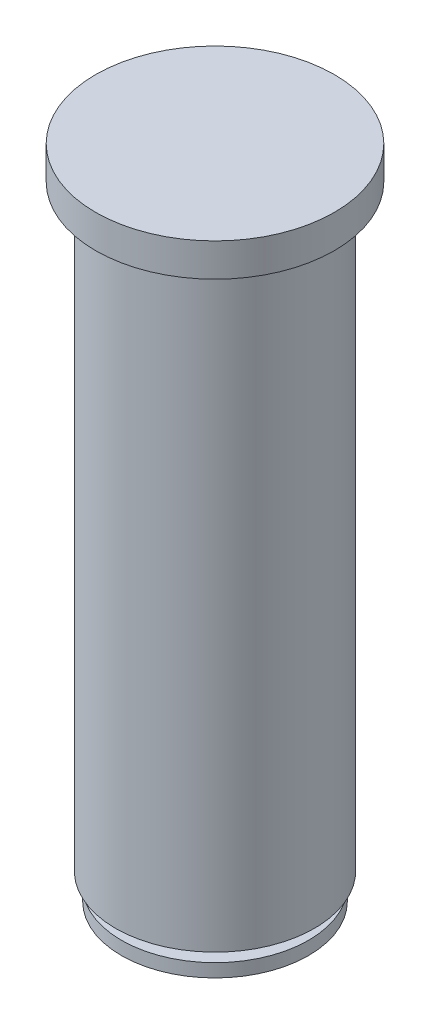
ISO-10303-21;
HEADER;
FILE_DESCRIPTION(('STEP AP214'),'2;1');
FILE_NAME('part.step','',(''),(''),'','','');
FILE_SCHEMA(('AUTOMOTIVE_DESIGN { 1 0 10303 214 1 1 1 1 }'));
ENDSEC;
DATA;
#1=APPLICATION_CONTEXT('core data for automotive mechanical design processes');
#2=APPLICATION_PROTOCOL_DEFINITION('international standard','automotive_design',2000,#1);
#3=PRODUCT_CONTEXT('',#1,'mechanical');
#4=PRODUCT('Part','Part','',(#3));
#5=PRODUCT_RELATED_PRODUCT_CATEGORY('part','',(#4));
#6=PRODUCT_DEFINITION_FORMATION('','',#4);
#7=PRODUCT_DEFINITION_CONTEXT('part definition',#1,'design');
#8=PRODUCT_DEFINITION('design','',#6,#7);
#9=PRODUCT_DEFINITION_SHAPE('','',#8);
#10=(LENGTH_UNIT() NAMED_UNIT(*) SI_UNIT(.MILLI.,.METRE.));
#11=(NAMED_UNIT(*) PLANE_ANGLE_UNIT() SI_UNIT($,.RADIAN.));
#12=(NAMED_UNIT(*) SI_UNIT($,.STERADIAN.) SOLID_ANGLE_UNIT());
#13=UNCERTAINTY_MEASURE_WITH_UNIT(LENGTH_MEASURE(1.E-05),#10,'distance_accuracy_value','');
#14=(GEOMETRIC_REPRESENTATION_CONTEXT(3) GLOBAL_UNCERTAINTY_ASSIGNED_CONTEXT((#13)) GLOBAL_UNIT_ASSIGNED_CONTEXT((#10,
#11,#12)) REPRESENTATION_CONTEXT('',''));
#15=CARTESIAN_POINT('',(0.,0.,0.));
#16=DIRECTION('',(0.,0.,1.));
#17=DIRECTION('',(1.,0.,0.));
#18=AXIS2_PLACEMENT_3D('',#15,#16,#17);
#19=CARTESIAN_POINT('',(0.,90.,0.));
#20=DIRECTION('',(0.,-1.,0.));
#21=DIRECTION('',(0.,0.,-1.));
#22=AXIS2_PLACEMENT_3D('',#19,#20,#21);
#23=CYLINDRICAL_SURFACE('',#22,15.);
#24=CARTESIAN_POINT('',(0.,90.,0.));
#25=DIRECTION('',(0.,1.,0.));
#26=DIRECTION('',(0.,0.,1.));
#27=AXIS2_PLACEMENT_3D('',#24,#25,#26);
#28=CIRCLE('',#27,15.);
#29=CARTESIAN_POINT('',(0.,90.,15.));
#30=VERTEX_POINT('',#29);
#31=EDGE_CURVE('E51',#30,#30,#28,.T.);
#32=ORIENTED_EDGE('',*,*,#31,.F.);
#33=EDGE_LOOP('',(#32));
#34=FACE_BOUND('',#33,.T.);
#35=CARTESIAN_POINT('',(0.,0.,0.));
#36=DIRECTION('',(0.,1.,0.));
#37=DIRECTION('',(0.,0.,1.));
#38=AXIS2_PLACEMENT_3D('',#35,#36,#37);
#39=CIRCLE('',#38,15.);
#40=CARTESIAN_POINT('',(0.,0.,15.));
#41=VERTEX_POINT('',#40);
#42=EDGE_CURVE('E46',#41,#41,#39,.T.);
#43=ORIENTED_EDGE('',*,*,#42,.T.);
#44=EDGE_LOOP('',(#43));
#45=FACE_BOUND('',#44,.T.);
#46=ADVANCED_FACE('F43',(#34,#45),#23,.T.);
#47=CARTESIAN_POINT('',(0.,0.,0.));
#48=DIRECTION('',(0.,1.,0.));
#49=DIRECTION('',(0.,0.,1.));
#50=AXIS2_PLACEMENT_3D('',#47,#48,#49);
#51=PLANE('',#50);
#52=CARTESIAN_POINT('',(0.,0.,0.));
#53=DIRECTION('',(0.,-1.,0.));
#54=DIRECTION('',(0.,0.,-1.));
#55=AXIS2_PLACEMENT_3D('',#52,#53,#54);
#56=CIRCLE('',#55,2.5);
#57=CARTESIAN_POINT('',(0.,0.,-2.5));
#58=VERTEX_POINT('',#57);
#59=EDGE_CURVE('E10',#58,#58,#56,.T.);
#60=ORIENTED_EDGE('',*,*,#59,.F.);
#61=EDGE_LOOP('',(#60));
#62=FACE_BOUND('',#61,.T.);
#63=ORIENTED_EDGE('',*,*,#42,.F.);
#64=EDGE_LOOP('',(#63));
#65=FACE_BOUND('',#64,.T.);
#66=ADVANCED_FACE('F97',(#62,#65),#51,.F.);
#67=CARTESIAN_POINT('',(0.,95.,0.));
#68=DIRECTION('',(0.,-1.,0.));
#69=DIRECTION('',(0.,0.,-1.));
#70=AXIS2_PLACEMENT_3D('',#67,#68,#69);
#71=CYLINDRICAL_SURFACE('',#70,18.);
#72=CARTESIAN_POINT('',(0.,95.,0.));
#73=DIRECTION('',(0.,1.,0.));
#74=DIRECTION('',(0.,0.,1.));
#75=AXIS2_PLACEMENT_3D('',#72,#73,#74);
#76=CIRCLE('',#75,18.);
#77=CARTESIAN_POINT('',(0.,95.,18.));
#78=VERTEX_POINT('',#77);
#79=EDGE_CURVE('E61',#78,#78,#76,.T.);
#80=ORIENTED_EDGE('',*,*,#79,.F.);
#81=EDGE_LOOP('',(#80));
#82=FACE_BOUND('',#81,.T.);
#83=CARTESIAN_POINT('',(0.,90.,0.));
#84=DIRECTION('',(0.,1.,0.));
#85=DIRECTION('',(0.,0.,1.));
#86=AXIS2_PLACEMENT_3D('',#83,#84,#85);
#87=CIRCLE('',#86,18.);
#88=CARTESIAN_POINT('',(0.,90.,18.));
#89=VERTEX_POINT('',#88);
#90=EDGE_CURVE('E65',#89,#89,#87,.T.);
#91=ORIENTED_EDGE('',*,*,#90,.T.);
#92=EDGE_LOOP('',(#91));
#93=FACE_BOUND('',#92,.T.);
#94=ADVANCED_FACE('F102',(#82,#93),#71,.T.);
#95=CARTESIAN_POINT('',(0.,95.,0.));
#96=DIRECTION('',(0.,1.,0.));
#97=DIRECTION('',(0.,0.,1.));
#98=AXIS2_PLACEMENT_3D('',#95,#96,#97);
#99=PLANE('',#98);
#100=ORIENTED_EDGE('',*,*,#79,.T.);
#101=EDGE_LOOP('',(#100));
#102=FACE_BOUND('',#101,.T.);
#103=ADVANCED_FACE('F115',(#102),#99,.T.);
#104=CARTESIAN_POINT('',(0.,90.,0.));
#105=DIRECTION('',(0.,1.,0.));
#106=DIRECTION('',(0.,0.,1.));
#107=AXIS2_PLACEMENT_3D('',#104,#105,#106);
#108=PLANE('',#107);
#109=ORIENTED_EDGE('',*,*,#31,.T.);
#110=EDGE_LOOP('',(#109));
#111=FACE_BOUND('',#110,.T.);
#112=ORIENTED_EDGE('',*,*,#90,.F.);
#113=EDGE_LOOP('',(#112));
#114=FACE_BOUND('',#113,.T.);
#115=ADVANCED_FACE('F111',(#111,#114),#108,.F.);
#116=CARTESIAN_POINT('',(0.,-2.,0.));
#117=DIRECTION('',(0.,1.,0.));
#118=DIRECTION('',(0.,0.,1.));
#119=AXIS2_PLACEMENT_3D('',#116,#117,#118);
#120=CYLINDRICAL_SURFACE('',#119,2.5);
#121=CARTESIAN_POINT('',(0.,-2.,0.));
#122=DIRECTION('',(0.,-1.,0.));
#123=DIRECTION('',(0.,0.,-1.));
#124=AXIS2_PLACEMENT_3D('',#121,#122,#123);
#125=CIRCLE('',#124,2.5);
#126=CARTESIAN_POINT('',(0.,-2.,-2.5));
#127=VERTEX_POINT('',#126);
#128=EDGE_CURVE('E59',#127,#127,#125,.T.);
#129=ORIENTED_EDGE('',*,*,#128,.F.);
#130=EDGE_LOOP('',(#129));
#131=FACE_BOUND('',#130,.T.);
#132=ORIENTED_EDGE('',*,*,#59,.T.);
#133=EDGE_LOOP('',(#132));
#134=FACE_BOUND('',#133,.T.);
#135=ADVANCED_FACE('F114',(#131,#134),#120,.T.);
#136=CARTESIAN_POINT('',(0.,-4.,0.));
#137=DIRECTION('',(0.,1.,0.));
#138=DIRECTION('',(0.,0.,1.));
#139=AXIS2_PLACEMENT_3D('',#136,#137,#138);
#140=CYLINDRICAL_SURFACE('',#139,14.1107917302115);
#141=CARTESIAN_POINT('',(0.,-4.,0.));
#142=DIRECTION('',(0.,-1.,0.));
#143=DIRECTION('',(0.,0.,-1.));
#144=AXIS2_PLACEMENT_3D('',#141,#142,#143);
#145=CIRCLE('',#144,14.1107917302115);
#146=CARTESIAN_POINT('',(0.,-4.,-14.1107917302115));
#147=VERTEX_POINT('',#146);
#148=EDGE_CURVE('E72',#147,#147,#145,.T.);
#149=ORIENTED_EDGE('',*,*,#148,.F.);
#150=EDGE_LOOP('',(#149));
#151=FACE_BOUND('',#150,.T.);
#152=CARTESIAN_POINT('',(0.,-2.,0.));
#153=DIRECTION('',(0.,-1.,0.));
#154=DIRECTION('',(0.,0.,-1.));
#155=AXIS2_PLACEMENT_3D('',#152,#153,#154);
#156=CIRCLE('',#155,14.1107917302115);
#157=CARTESIAN_POINT('',(0.,-2.,-14.1107917302115));
#158=VERTEX_POINT('',#157);
#159=EDGE_CURVE('E77',#158,#158,#156,.T.);
#160=ORIENTED_EDGE('',*,*,#159,.T.);
#161=EDGE_LOOP('',(#160));
#162=FACE_BOUND('',#161,.T.);
#163=ADVANCED_FACE('F85',(#151,#162),#140,.T.);
#164=CARTESIAN_POINT('',(0.,-4.,0.));
#165=DIRECTION('',(0.,-1.,0.));
#166=DIRECTION('',(0.,0.,-1.));
#167=AXIS2_PLACEMENT_3D('',#164,#165,#166);
#168=PLANE('',#167);
#169=ORIENTED_EDGE('',*,*,#148,.T.);
#170=EDGE_LOOP('',(#169));
#171=FACE_BOUND('',#170,.T.);
#172=ADVANCED_FACE('F89',(#171),#168,.T.);
#173=CARTESIAN_POINT('',(0.,-2.,0.));
#174=DIRECTION('',(0.,-1.,0.));
#175=DIRECTION('',(0.,0.,-1.));
#176=AXIS2_PLACEMENT_3D('',#173,#174,#175);
#177=PLANE('',#176);
#178=ORIENTED_EDGE('',*,*,#128,.T.);
#179=EDGE_LOOP('',(#178));
#180=FACE_BOUND('',#179,.T.);
#181=ORIENTED_EDGE('',*,*,#159,.F.);
#182=EDGE_LOOP('',(#181));
#183=FACE_BOUND('',#182,.T.);
#184=ADVANCED_FACE('F87',(#180,#183),#177,.F.);
#185=CLOSED_SHELL('',(#46,#66,#94,#103,#115,#135,#163,#172,#184));
#186=MANIFOLD_SOLID_BREP('B2',#185);
#187=ADVANCED_BREP_SHAPE_REPRESENTATION('',(#18,#186),#14);
#188=SHAPE_DEFINITION_REPRESENTATION(#9,#187);
ENDSEC;
END-ISO-10303-21;
